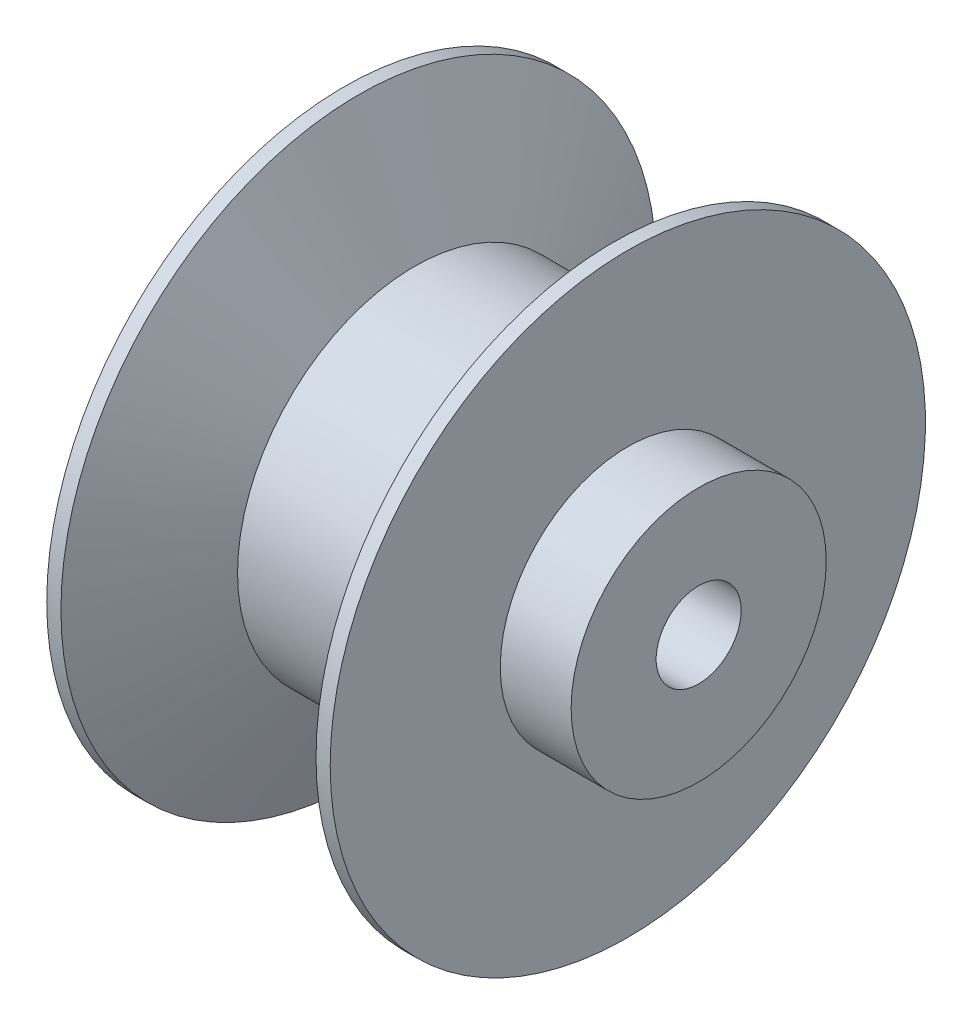
ISO-10303-21;
HEADER;
FILE_DESCRIPTION(('STEP AP214'),'2;1');
FILE_NAME('part.step','',(''),(''),'','','');
FILE_SCHEMA(('AUTOMOTIVE_DESIGN { 1 0 10303 214 1 1 1 1 }'));
ENDSEC;
DATA;
#1=APPLICATION_CONTEXT('core data for automotive mechanical design processes');
#2=APPLICATION_PROTOCOL_DEFINITION('international standard','automotive_design',2000,#1);
#3=PRODUCT_CONTEXT('',#1,'mechanical');
#4=PRODUCT('Part','Part','',(#3));
#5=PRODUCT_RELATED_PRODUCT_CATEGORY('part','',(#4));
#6=PRODUCT_DEFINITION_FORMATION('','',#4);
#7=PRODUCT_DEFINITION_CONTEXT('part definition',#1,'design');
#8=PRODUCT_DEFINITION('design','',#6,#7);
#9=PRODUCT_DEFINITION_SHAPE('','',#8);
#10=(LENGTH_UNIT() NAMED_UNIT(*) SI_UNIT(.MILLI.,.METRE.));
#11=(NAMED_UNIT(*) PLANE_ANGLE_UNIT() SI_UNIT($,.RADIAN.));
#12=(NAMED_UNIT(*) SI_UNIT($,.STERADIAN.) SOLID_ANGLE_UNIT());
#13=UNCERTAINTY_MEASURE_WITH_UNIT(LENGTH_MEASURE(1.E-05),#10,'distance_accuracy_value','');
#14=(GEOMETRIC_REPRESENTATION_CONTEXT(3) GLOBAL_UNCERTAINTY_ASSIGNED_CONTEXT((#13)) GLOBAL_UNIT_ASSIGNED_CONTEXT((#10,
#11,#12)) REPRESENTATION_CONTEXT('',''));
#15=CARTESIAN_POINT('',(0.,0.,0.));
#16=DIRECTION('',(0.,0.,1.));
#17=DIRECTION('',(1.,0.,0.));
#18=AXIS2_PLACEMENT_3D('',#15,#16,#17);
#19=CARTESIAN_POINT('',(-128.723358614262,0.,0.));
#20=DIRECTION('',(-1.,0.,0.));
#21=DIRECTION('',(0.,0.,1.));
#22=AXIS2_PLACEMENT_3D('',#19,#20,#21);
#23=CYLINDRICAL_SURFACE('',#22,3.);
#24=CARTESIAN_POINT('',(-65.657677475335,0.,0.));
#25=DIRECTION('',(-1.,0.,0.));
#26=DIRECTION('',(0.,0.,1.));
#27=AXIS2_PLACEMENT_3D('',#24,#25,#26);
#28=CIRCLE('',#27,3.);
#29=CARTESIAN_POINT('',(-65.657677475335,0.,3.));
#30=VERTEX_POINT('',#29);
#31=EDGE_CURVE('E39',#30,#30,#28,.T.);
#32=ORIENTED_EDGE('',*,*,#31,.T.);
#33=EDGE_LOOP('',(#32));
#34=FACE_BOUND('',#33,.T.);
#35=CARTESIAN_POINT('',(-45.657677475335,0.,0.));
#36=DIRECTION('',(1.,0.,0.));
#37=DIRECTION('',(0.,0.,-1.));
#38=AXIS2_PLACEMENT_3D('',#35,#36,#37);
#39=CIRCLE('',#38,3.);
#40=CARTESIAN_POINT('',(-45.657677475335,0.,-3.));
#41=VERTEX_POINT('',#40);
#42=EDGE_CURVE('E35',#41,#41,#39,.F.);
#43=ORIENTED_EDGE('',*,*,#42,.F.);
#44=EDGE_LOOP('',(#43));
#45=FACE_BOUND('',#44,.T.);
#46=ADVANCED_FACE('F31',(#34,#45),#23,.F.);
#47=CARTESIAN_POINT('',(-128.723358614262,0.,0.));
#48=DIRECTION('',(-1.,0.,0.));
#49=DIRECTION('',(0.,0.,1.));
#50=AXIS2_PLACEMENT_3D('',#47,#48,#49);
#51=CYLINDRICAL_SURFACE('',#50,18.);
#52=CARTESIAN_POINT('',(-65.657677475335,0.,0.));
#53=DIRECTION('',(-1.,0.,0.));
#54=DIRECTION('',(0.,0.,1.));
#55=AXIS2_PLACEMENT_3D('',#52,#53,#54);
#56=CIRCLE('',#55,18.);
#57=CARTESIAN_POINT('',(-65.657677475335,0.,18.));
#58=VERTEX_POINT('',#57);
#59=EDGE_CURVE('E10',#58,#58,#56,.T.);
#60=ORIENTED_EDGE('',*,*,#59,.F.);
#61=EDGE_LOOP('',(#60));
#62=FACE_BOUND('',#61,.T.);
#63=CARTESIAN_POINT('',(-55.657677475335,0.,0.));
#64=DIRECTION('',(-1.,0.,0.));
#65=DIRECTION('',(0.,0.,1.));
#66=AXIS2_PLACEMENT_3D('',#63,#64,#65);
#67=CIRCLE('',#66,18.);
#68=CARTESIAN_POINT('',(-55.657677475335,0.,18.));
#69=VERTEX_POINT('',#68);
#70=EDGE_CURVE('E69',#69,#69,#67,.T.);
#71=ORIENTED_EDGE('',*,*,#70,.T.);
#72=EDGE_LOOP('',(#71));
#73=FACE_BOUND('',#72,.T.);
#74=ADVANCED_FACE('F33',(#62,#73),#51,.T.);
#75=CARTESIAN_POINT('',(-65.657677475335,18.,0.));
#76=DIRECTION('',(1.,0.,0.));
#77=DIRECTION('',(0.,0.,-1.));
#78=AXIS2_PLACEMENT_3D('',#75,#76,#77);
#79=PLANE('',#78);
#80=ORIENTED_EDGE('',*,*,#31,.F.);
#81=EDGE_LOOP('',(#80));
#82=FACE_BOUND('',#81,.T.);
#83=ORIENTED_EDGE('',*,*,#59,.T.);
#84=EDGE_LOOP('',(#83));
#85=FACE_BOUND('',#84,.T.);
#86=ADVANCED_FACE('F90',(#82,#85),#79,.F.);
#87=CARTESIAN_POINT('',(-5.65767747533502,18.,0.));
#88=DIRECTION('',(-1.,0.,0.));
#89=DIRECTION('',(0.,0.,1.));
#90=AXIS2_PLACEMENT_3D('',#87,#88,#89);
#91=PLANE('',#90);
#92=CARTESIAN_POINT('',(-5.65767747533502,0.,0.));
#93=DIRECTION('',(1.,0.,0.));
#94=DIRECTION('',(0.,0.,-1.));
#95=AXIS2_PLACEMENT_3D('',#92,#93,#94);
#96=CIRCLE('',#95,6.);
#97=CARTESIAN_POINT('',(-5.65767747533502,0.,-6.));
#98=VERTEX_POINT('',#97);
#99=EDGE_CURVE('E72',#98,#98,#96,.T.);
#100=ORIENTED_EDGE('',*,*,#99,.F.);
#101=EDGE_LOOP('',(#100));
#102=FACE_BOUND('',#101,.T.);
#103=CARTESIAN_POINT('',(-5.65767747533502,0.,0.));
#104=DIRECTION('',(-1.,0.,0.));
#105=DIRECTION('',(0.,0.,1.));
#106=AXIS2_PLACEMENT_3D('',#103,#104,#105);
#107=CIRCLE('',#106,18.);
#108=CARTESIAN_POINT('',(-5.65767747533502,0.,18.));
#109=VERTEX_POINT('',#108);
#110=EDGE_CURVE('E43',#109,#109,#107,.T.);
#111=ORIENTED_EDGE('',*,*,#110,.F.);
#112=EDGE_LOOP('',(#111));
#113=FACE_BOUND('',#112,.T.);
#114=ADVANCED_FACE('F93',(#102,#113),#91,.F.);
#115=CARTESIAN_POINT('',(-128.723358614262,0.,0.));
#116=DIRECTION('',(-1.,0.,0.));
#117=DIRECTION('',(0.,0.,1.));
#118=AXIS2_PLACEMENT_3D('',#115,#116,#117);
#119=CYLINDRICAL_SURFACE('',#118,18.);
#120=CARTESIAN_POINT('',(-15.657677475335,0.,0.));
#121=DIRECTION('',(-1.,0.,0.));
#122=DIRECTION('',(0.,0.,1.));
#123=AXIS2_PLACEMENT_3D('',#120,#121,#122);
#124=CIRCLE('',#123,18.);
#125=CARTESIAN_POINT('',(-15.657677475335,0.,18.));
#126=VERTEX_POINT('',#125);
#127=EDGE_CURVE('E48',#126,#126,#124,.T.);
#128=ORIENTED_EDGE('',*,*,#127,.F.);
#129=EDGE_LOOP('',(#128));
#130=FACE_BOUND('',#129,.T.);
#131=ORIENTED_EDGE('',*,*,#110,.T.);
#132=EDGE_LOOP('',(#131));
#133=FACE_BOUND('',#132,.T.);
#134=ADVANCED_FACE('F100',(#130,#133),#119,.T.);
#135=CARTESIAN_POINT('',(-15.657677475335,42.,0.));
#136=DIRECTION('',(-1.,0.,0.));
#137=DIRECTION('',(0.,0.,1.));
#138=AXIS2_PLACEMENT_3D('',#135,#136,#137);
#139=PLANE('',#138);
#140=CARTESIAN_POINT('',(-15.657677475335,0.,0.));
#141=DIRECTION('',(-1.,0.,0.));
#142=DIRECTION('',(0.,0.,1.));
#143=AXIS2_PLACEMENT_3D('',#140,#141,#142);
#144=CIRCLE('',#143,42.);
#145=CARTESIAN_POINT('',(-15.657677475335,0.,42.));
#146=VERTEX_POINT('',#145);
#147=EDGE_CURVE('E51',#146,#146,#144,.T.);
#148=ORIENTED_EDGE('',*,*,#147,.F.);
#149=EDGE_LOOP('',(#148));
#150=FACE_BOUND('',#149,.T.);
#151=ORIENTED_EDGE('',*,*,#127,.T.);
#152=EDGE_LOOP('',(#151));
#153=FACE_BOUND('',#152,.T.);
#154=ADVANCED_FACE('F106',(#150,#153),#139,.F.);
#155=CARTESIAN_POINT('',(-128.723358614262,0.,0.));
#156=DIRECTION('',(-1.,0.,0.));
#157=DIRECTION('',(0.,0.,1.));
#158=AXIS2_PLACEMENT_3D('',#155,#156,#157);
#159=CYLINDRICAL_SURFACE('',#158,42.);
#160=CARTESIAN_POINT('',(-17.657677475335,0.,0.));
#161=DIRECTION('',(-1.,0.,0.));
#162=DIRECTION('',(0.,0.,1.));
#163=AXIS2_PLACEMENT_3D('',#160,#161,#162);
#164=CIRCLE('',#163,42.);
#165=CARTESIAN_POINT('',(-17.657677475335,0.,42.));
#166=VERTEX_POINT('',#165);
#167=EDGE_CURVE('E54',#166,#166,#164,.T.);
#168=ORIENTED_EDGE('',*,*,#167,.F.);
#169=EDGE_LOOP('',(#168));
#170=FACE_BOUND('',#169,.T.);
#171=ORIENTED_EDGE('',*,*,#147,.T.);
#172=EDGE_LOOP('',(#171));
#173=FACE_BOUND('',#172,.T.);
#174=ADVANCED_FACE('F141',(#170,#173),#159,.T.);
#175=CARTESIAN_POINT('',(-17.657677475335,0.,0.));
#176=DIRECTION('',(1.,0.,0.));
#177=DIRECTION('',(0.,0.,-1.));
#178=AXIS2_PLACEMENT_3D('',#175,#176,#177);
#179=CONICAL_SURFACE('',#178,42.,1.13446401379632);
#180=CARTESIAN_POINT('',(-25.5849076639699,0.,0.));
#181=DIRECTION('',(-1.,0.,0.));
#182=DIRECTION('',(0.,0.,1.));
#183=AXIS2_PLACEMENT_3D('',#180,#181,#182);
#184=CIRCLE('',#183,25.);
#185=CARTESIAN_POINT('',(-25.5849076639699,0.,25.));
#186=VERTEX_POINT('',#185);
#187=EDGE_CURVE('E57',#186,#186,#184,.T.);
#188=ORIENTED_EDGE('',*,*,#187,.F.);
#189=EDGE_LOOP('',(#188));
#190=FACE_BOUND('',#189,.T.);
#191=ORIENTED_EDGE('',*,*,#167,.T.);
#192=EDGE_LOOP('',(#191));
#193=FACE_BOUND('',#192,.T.);
#194=ADVANCED_FACE('F137',(#190,#193),#179,.T.);
#195=CARTESIAN_POINT('',(-128.723358614262,0.,0.));
#196=DIRECTION('',(-1.,0.,0.));
#197=DIRECTION('',(0.,0.,1.));
#198=AXIS2_PLACEMENT_3D('',#195,#196,#197);
#199=CYLINDRICAL_SURFACE('',#198,25.);
#200=CARTESIAN_POINT('',(-45.7304472867001,0.,0.));
#201=DIRECTION('',(-1.,0.,0.));
#202=DIRECTION('',(0.,0.,1.));
#203=AXIS2_PLACEMENT_3D('',#200,#201,#202);
#204=CIRCLE('',#203,25.);
#205=CARTESIAN_POINT('',(-45.7304472867001,0.,25.));
#206=VERTEX_POINT('',#205);
#207=EDGE_CURVE('E60',#206,#206,#204,.T.);
#208=ORIENTED_EDGE('',*,*,#207,.F.);
#209=EDGE_LOOP('',(#208));
#210=FACE_BOUND('',#209,.T.);
#211=ORIENTED_EDGE('',*,*,#187,.T.);
#212=EDGE_LOOP('',(#211));
#213=FACE_BOUND('',#212,.T.);
#214=ADVANCED_FACE('F133',(#210,#213),#199,.T.);
#215=CARTESIAN_POINT('',(-45.7304472867001,0.,0.));
#216=DIRECTION('',(-1.,0.,0.));
#217=DIRECTION('',(0.,0.,1.));
#218=AXIS2_PLACEMENT_3D('',#215,#216,#217);
#219=CONICAL_SURFACE('',#218,25.,1.13446401379632);
#220=CARTESIAN_POINT('',(-53.657677475335,0.,0.));
#221=DIRECTION('',(-1.,0.,0.));
#222=DIRECTION('',(0.,0.,1.));
#223=AXIS2_PLACEMENT_3D('',#220,#221,#222);
#224=CIRCLE('',#223,42.);
#225=CARTESIAN_POINT('',(-53.657677475335,0.,42.));
#226=VERTEX_POINT('',#225);
#227=EDGE_CURVE('E63',#226,#226,#224,.T.);
#228=ORIENTED_EDGE('',*,*,#227,.F.);
#229=EDGE_LOOP('',(#228));
#230=FACE_BOUND('',#229,.T.);
#231=ORIENTED_EDGE('',*,*,#207,.T.);
#232=EDGE_LOOP('',(#231));
#233=FACE_BOUND('',#232,.T.);
#234=ADVANCED_FACE('F129',(#230,#233),#219,.T.);
#235=CARTESIAN_POINT('',(-128.723358614262,0.,0.));
#236=DIRECTION('',(-1.,0.,0.));
#237=DIRECTION('',(0.,0.,1.));
#238=AXIS2_PLACEMENT_3D('',#235,#236,#237);
#239=CYLINDRICAL_SURFACE('',#238,42.);
#240=CARTESIAN_POINT('',(-55.657677475335,0.,0.));
#241=DIRECTION('',(-1.,0.,0.));
#242=DIRECTION('',(0.,0.,1.));
#243=AXIS2_PLACEMENT_3D('',#240,#241,#242);
#244=CIRCLE('',#243,42.);
#245=CARTESIAN_POINT('',(-55.657677475335,0.,42.));
#246=VERTEX_POINT('',#245);
#247=EDGE_CURVE('E66',#246,#246,#244,.T.);
#248=ORIENTED_EDGE('',*,*,#247,.F.);
#249=EDGE_LOOP('',(#248));
#250=FACE_BOUND('',#249,.T.);
#251=ORIENTED_EDGE('',*,*,#227,.T.);
#252=EDGE_LOOP('',(#251));
#253=FACE_BOUND('',#252,.T.);
#254=ADVANCED_FACE('F125',(#250,#253),#239,.T.);
#255=CARTESIAN_POINT('',(-55.657677475335,42.,0.));
#256=DIRECTION('',(1.,0.,0.));
#257=DIRECTION('',(0.,0.,-1.));
#258=AXIS2_PLACEMENT_3D('',#255,#256,#257);
#259=PLANE('',#258);
#260=ORIENTED_EDGE('',*,*,#70,.F.);
#261=EDGE_LOOP('',(#260));
#262=FACE_BOUND('',#261,.T.);
#263=ORIENTED_EDGE('',*,*,#247,.T.);
#264=EDGE_LOOP('',(#263));
#265=FACE_BOUND('',#264,.T.);
#266=ADVANCED_FACE('F120',(#262,#265),#259,.F.);
#267=CARTESIAN_POINT('',(-45.657677475335,0.,0.));
#268=DIRECTION('',(1.,0.,0.));
#269=DIRECTION('',(0.,0.,-1.));
#270=AXIS2_PLACEMENT_3D('',#267,#268,#269);
#271=PLANE('',#270);
#272=CARTESIAN_POINT('',(-45.657677475335,0.,0.));
#273=DIRECTION('',(1.,0.,0.));
#274=DIRECTION('',(0.,0.,-1.));
#275=AXIS2_PLACEMENT_3D('',#272,#273,#274);
#276=CIRCLE('',#275,6.);
#277=CARTESIAN_POINT('',(-45.657677475335,0.,-6.));
#278=VERTEX_POINT('',#277);
#279=EDGE_CURVE('E75',#278,#278,#276,.T.);
#280=ORIENTED_EDGE('',*,*,#279,.T.);
#281=EDGE_LOOP('',(#280));
#282=FACE_BOUND('',#281,.T.);
#283=ORIENTED_EDGE('',*,*,#42,.T.);
#284=EDGE_LOOP('',(#283));
#285=FACE_BOUND('',#284,.T.);
#286=ADVANCED_FACE('F82',(#282,#285),#271,.T.);
#287=CARTESIAN_POINT('',(-45.657677475335,0.,0.));
#288=DIRECTION('',(1.,0.,0.));
#289=DIRECTION('',(0.,0.,-1.));
#290=AXIS2_PLACEMENT_3D('',#287,#288,#289);
#291=CYLINDRICAL_SURFACE('',#290,6.);
#292=ORIENTED_EDGE('',*,*,#279,.F.);
#293=EDGE_LOOP('',(#292));
#294=FACE_BOUND('',#293,.T.);
#295=ORIENTED_EDGE('',*,*,#99,.T.);
#296=EDGE_LOOP('',(#295));
#297=FACE_BOUND('',#296,.T.);
#298=ADVANCED_FACE('F113',(#294,#297),#291,.F.);
#299=CLOSED_SHELL('',(#46,#74,#86,#114,#134,#154,#174,#194,#214,#234,#254,#266,#286,#298));
#300=MANIFOLD_SOLID_BREP('B2',#299);
#301=ADVANCED_BREP_SHAPE_REPRESENTATION('',(#18,#300),#14);
#302=SHAPE_DEFINITION_REPRESENTATION(#9,#301);
ENDSEC;
END-ISO-10303-21;
